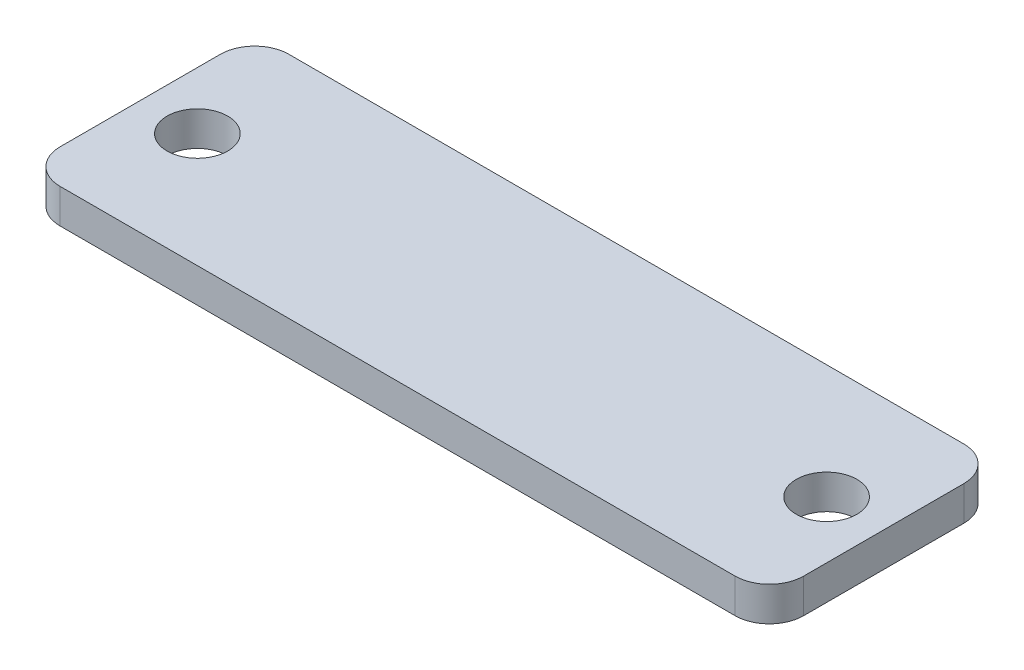
ISO-10303-21;
HEADER;
FILE_DESCRIPTION(('STEP AP214'),'2;1');
FILE_NAME('part.step','',(''),(''),'','','');
FILE_SCHEMA(('AUTOMOTIVE_DESIGN { 1 0 10303 214 1 1 1 1 }'));
ENDSEC;
DATA;
#1=APPLICATION_CONTEXT('core data for automotive mechanical design processes');
#2=APPLICATION_PROTOCOL_DEFINITION('international standard','automotive_design',2000,#1);
#3=PRODUCT_CONTEXT('',#1,'mechanical');
#4=PRODUCT('Part','Part','',(#3));
#5=PRODUCT_RELATED_PRODUCT_CATEGORY('part','',(#4));
#6=PRODUCT_DEFINITION_FORMATION('','',#4);
#7=PRODUCT_DEFINITION_CONTEXT('part definition',#1,'design');
#8=PRODUCT_DEFINITION('design','',#6,#7);
#9=PRODUCT_DEFINITION_SHAPE('','',#8);
#10=(LENGTH_UNIT() NAMED_UNIT(*) SI_UNIT(.MILLI.,.METRE.));
#11=(NAMED_UNIT(*) PLANE_ANGLE_UNIT() SI_UNIT($,.RADIAN.));
#12=(NAMED_UNIT(*) SI_UNIT($,.STERADIAN.) SOLID_ANGLE_UNIT());
#13=UNCERTAINTY_MEASURE_WITH_UNIT(LENGTH_MEASURE(1.E-05),#10,'distance_accuracy_value','');
#14=(GEOMETRIC_REPRESENTATION_CONTEXT(3) GLOBAL_UNCERTAINTY_ASSIGNED_CONTEXT((#13)) GLOBAL_UNIT_ASSIGNED_CONTEXT((#10,
#11,#12)) REPRESENTATION_CONTEXT('',''));
#15=CARTESIAN_POINT('',(0.,0.,0.));
#16=DIRECTION('',(0.,0.,1.));
#17=DIRECTION('',(1.,0.,0.));
#18=AXIS2_PLACEMENT_3D('',#15,#16,#17);
#19=CARTESIAN_POINT('',(0.,3.,0.));
#20=DIRECTION('',(0.,1.,0.));
#21=DIRECTION('',(0.,0.,1.));
#22=AXIS2_PLACEMENT_3D('',#19,#20,#21);
#23=PLANE('',#22);
#24=CARTESIAN_POINT('',(-27.5,3.,19.));
#25=DIRECTION('',(0.,-1.,0.));
#26=DIRECTION('',(0.,0.,-1.));
#27=AXIS2_PLACEMENT_3D('',#24,#25,#26);
#28=CIRCLE('',#27,2.65);
#29=CARTESIAN_POINT('',(-27.5,3.,16.35));
#30=VERTEX_POINT('',#29);
#31=EDGE_CURVE('E206',#30,#30,#28,.T.);
#32=ORIENTED_EDGE('',*,*,#31,.T.);
#33=EDGE_LOOP('',(#32));
#34=FACE_BOUND('',#33,.T.);
#35=CARTESIAN_POINT('',(27.5,3.,19.));
#36=DIRECTION('',(0.,-1.,0.));
#37=DIRECTION('',(0.,0.,-1.));
#38=AXIS2_PLACEMENT_3D('',#35,#36,#37);
#39=CIRCLE('',#38,2.65);
#40=CARTESIAN_POINT('',(27.5,3.,16.35));
#41=VERTEX_POINT('',#40);
#42=EDGE_CURVE('E198',#41,#41,#39,.T.);
#43=ORIENTED_EDGE('',*,*,#42,.T.);
#44=EDGE_LOOP('',(#43));
#45=FACE_BOUND('',#44,.T.);
#46=DIRECTION('',(1.,0.,0.));
#47=VECTOR('',#46,1.);
#48=CARTESIAN_POINT('',(0.,3.,29.));
#49=LINE('',#48,#47);
#50=CARTESIAN_POINT('',(-29.5,3.,29.));
#51=VERTEX_POINT('',#50);
#52=CARTESIAN_POINT('',(29.5,3.,29.));
#53=VERTEX_POINT('',#52);
#54=EDGE_CURVE('E140',#51,#53,#49,.T.);
#55=ORIENTED_EDGE('',*,*,#54,.T.);
#56=CARTESIAN_POINT('',(29.5,3.,26.));
#57=DIRECTION('',(0.,1.,0.));
#58=DIRECTION('',(0.,0.,1.));
#59=AXIS2_PLACEMENT_3D('',#56,#57,#58);
#60=CIRCLE('',#59,3.);
#61=CARTESIAN_POINT('',(32.5,3.,26.));
#62=VERTEX_POINT('',#61);
#63=EDGE_CURVE('E168',#53,#62,#60,.T.);
#64=ORIENTED_EDGE('',*,*,#63,.T.);
#65=DIRECTION('',(0.,0.,-1.));
#66=VECTOR('',#65,1.);
#67=CARTESIAN_POINT('',(32.5,3.,0.));
#68=LINE('',#67,#66);
#69=CARTESIAN_POINT('',(32.5,3.,12.));
#70=VERTEX_POINT('',#69);
#71=EDGE_CURVE('E127',#62,#70,#68,.T.);
#72=ORIENTED_EDGE('',*,*,#71,.T.);
#73=CARTESIAN_POINT('',(29.5,3.,12.));
#74=DIRECTION('',(0.,1.,0.));
#75=DIRECTION('',(0.,0.,1.));
#76=AXIS2_PLACEMENT_3D('',#73,#74,#75);
#77=CIRCLE('',#76,3.);
#78=CARTESIAN_POINT('',(29.5,3.,9.));
#79=VERTEX_POINT('',#78);
#80=EDGE_CURVE('E160',#70,#79,#77,.T.);
#81=ORIENTED_EDGE('',*,*,#80,.T.);
#82=DIRECTION('',(1.,0.,0.));
#83=VECTOR('',#82,1.);
#84=CARTESIAN_POINT('',(0.,3.,9.));
#85=LINE('',#84,#83);
#86=CARTESIAN_POINT('',(-29.5,3.,9.));
#87=VERTEX_POINT('',#86);
#88=EDGE_CURVE('E185',#87,#79,#85,.T.);
#89=ORIENTED_EDGE('',*,*,#88,.F.);
#90=CARTESIAN_POINT('',(-29.5,3.,12.));
#91=DIRECTION('',(0.,1.,0.));
#92=DIRECTION('',(0.,0.,1.));
#93=AXIS2_PLACEMENT_3D('',#90,#91,#92);
#94=CIRCLE('',#93,3.);
#95=CARTESIAN_POINT('',(-32.5,3.,12.));
#96=VERTEX_POINT('',#95);
#97=EDGE_CURVE('E55',#87,#96,#94,.T.);
#98=ORIENTED_EDGE('',*,*,#97,.T.);
#99=DIRECTION('',(0.,0.,-1.));
#100=VECTOR('',#99,1.);
#101=CARTESIAN_POINT('',(-32.5,3.,0.));
#102=LINE('',#101,#100);
#103=CARTESIAN_POINT('',(-32.5,3.,26.));
#104=VERTEX_POINT('',#103);
#105=EDGE_CURVE('E135',#104,#96,#102,.T.);
#106=ORIENTED_EDGE('',*,*,#105,.F.);
#107=CARTESIAN_POINT('',(-29.5,3.,26.));
#108=DIRECTION('',(0.,1.,0.));
#109=DIRECTION('',(0.,0.,1.));
#110=AXIS2_PLACEMENT_3D('',#107,#108,#109);
#111=CIRCLE('',#110,3.);
#112=EDGE_CURVE('E165',#104,#51,#111,.T.);
#113=ORIENTED_EDGE('',*,*,#112,.T.);
#114=EDGE_LOOP('',(#55,#64,#72,#81,#89,#98,#106,#113));
#115=FACE_BOUND('',#114,.T.);
#116=ADVANCED_FACE('F39',(#34,#45,#115),#23,.T.);
#117=CARTESIAN_POINT('',(0.,0.,0.));
#118=DIRECTION('',(0.,1.,0.));
#119=DIRECTION('',(0.,0.,1.));
#120=AXIS2_PLACEMENT_3D('',#117,#118,#119);
#121=PLANE('',#120);
#122=CARTESIAN_POINT('',(-27.5,0.,19.));
#123=DIRECTION('',(0.,-1.,0.));
#124=DIRECTION('',(0.,0.,-1.));
#125=AXIS2_PLACEMENT_3D('',#122,#123,#124);
#126=CIRCLE('',#125,2.65);
#127=CARTESIAN_POINT('',(-27.5,0.,16.35));
#128=VERTEX_POINT('',#127);
#129=EDGE_CURVE('E202',#128,#128,#126,.T.);
#130=ORIENTED_EDGE('',*,*,#129,.F.);
#131=EDGE_LOOP('',(#130));
#132=FACE_BOUND('',#131,.T.);
#133=CARTESIAN_POINT('',(27.5,0.,19.));
#134=DIRECTION('',(0.,-1.,0.));
#135=DIRECTION('',(0.,0.,-1.));
#136=AXIS2_PLACEMENT_3D('',#133,#134,#135);
#137=CIRCLE('',#136,2.65);
#138=CARTESIAN_POINT('',(27.5,0.,16.35));
#139=VERTEX_POINT('',#138);
#140=EDGE_CURVE('E192',#139,#139,#137,.T.);
#141=ORIENTED_EDGE('',*,*,#140,.F.);
#142=EDGE_LOOP('',(#141));
#143=FACE_BOUND('',#142,.T.);
#144=DIRECTION('',(0.,0.,-1.));
#145=VECTOR('',#144,1.);
#146=CARTESIAN_POINT('',(32.5,0.,0.));
#147=LINE('',#146,#145);
#148=CARTESIAN_POINT('',(32.5,0.,26.));
#149=VERTEX_POINT('',#148);
#150=CARTESIAN_POINT('',(32.5,0.,12.));
#151=VERTEX_POINT('',#150);
#152=EDGE_CURVE('E124',#149,#151,#147,.T.);
#153=ORIENTED_EDGE('',*,*,#152,.F.);
#154=CARTESIAN_POINT('',(29.5,0.,26.));
#155=DIRECTION('',(0.,1.,0.));
#156=DIRECTION('',(0.,0.,1.));
#157=AXIS2_PLACEMENT_3D('',#154,#155,#156);
#158=CIRCLE('',#157,3.);
#159=CARTESIAN_POINT('',(29.5,0.,29.));
#160=VERTEX_POINT('',#159);
#161=EDGE_CURVE('E106',#149,#160,#158,.F.);
#162=ORIENTED_EDGE('',*,*,#161,.T.);
#163=DIRECTION('',(1.,0.,0.));
#164=VECTOR('',#163,1.);
#165=CARTESIAN_POINT('',(0.,0.,29.));
#166=LINE('',#165,#164);
#167=CARTESIAN_POINT('',(-29.5,0.,29.));
#168=VERTEX_POINT('',#167);
#169=EDGE_CURVE('E136',#168,#160,#166,.T.);
#170=ORIENTED_EDGE('',*,*,#169,.F.);
#171=CARTESIAN_POINT('',(-29.5,0.,26.));
#172=DIRECTION('',(0.,1.,0.));
#173=DIRECTION('',(0.,0.,1.));
#174=AXIS2_PLACEMENT_3D('',#171,#172,#173);
#175=CIRCLE('',#174,3.);
#176=CARTESIAN_POINT('',(-32.5,0.,26.));
#177=VERTEX_POINT('',#176);
#178=EDGE_CURVE('E118',#168,#177,#175,.F.);
#179=ORIENTED_EDGE('',*,*,#178,.T.);
#180=DIRECTION('',(0.,0.,-1.));
#181=VECTOR('',#180,1.);
#182=CARTESIAN_POINT('',(-32.5,0.,0.));
#183=LINE('',#182,#181);
#184=CARTESIAN_POINT('',(-32.5,0.,12.));
#185=VERTEX_POINT('',#184);
#186=EDGE_CURVE('E142',#177,#185,#183,.T.);
#187=ORIENTED_EDGE('',*,*,#186,.T.);
#188=CARTESIAN_POINT('',(-29.5,0.,12.));
#189=DIRECTION('',(0.,1.,0.));
#190=DIRECTION('',(0.,0.,1.));
#191=AXIS2_PLACEMENT_3D('',#188,#189,#190);
#192=CIRCLE('',#191,3.);
#193=CARTESIAN_POINT('',(-29.5,0.,9.));
#194=VERTEX_POINT('',#193);
#195=EDGE_CURVE('E150',#185,#194,#192,.F.);
#196=ORIENTED_EDGE('',*,*,#195,.T.);
#197=DIRECTION('',(1.,0.,0.));
#198=VECTOR('',#197,1.);
#199=CARTESIAN_POINT('',(0.,0.,9.));
#200=LINE('',#199,#198);
#201=CARTESIAN_POINT('',(29.5,0.,9.));
#202=VERTEX_POINT('',#201);
#203=EDGE_CURVE('E183',#194,#202,#200,.T.);
#204=ORIENTED_EDGE('',*,*,#203,.T.);
#205=CARTESIAN_POINT('',(29.5,0.,12.));
#206=DIRECTION('',(0.,1.,0.));
#207=DIRECTION('',(0.,0.,1.));
#208=AXIS2_PLACEMENT_3D('',#205,#206,#207);
#209=CIRCLE('',#208,3.);
#210=EDGE_CURVE('E129',#202,#151,#209,.F.);
#211=ORIENTED_EDGE('',*,*,#210,.T.);
#212=EDGE_LOOP('',(#153,#162,#170,#179,#187,#196,#204,#211));
#213=FACE_BOUND('',#212,.T.);
#214=ADVANCED_FACE('F132',(#132,#143,#213),#121,.F.);
#215=CARTESIAN_POINT('',(-32.5,3.,0.));
#216=DIRECTION('',(-1.,0.,0.));
#217=DIRECTION('',(0.,0.,1.));
#218=AXIS2_PLACEMENT_3D('',#215,#216,#217);
#219=PLANE('',#218);
#220=ORIENTED_EDGE('',*,*,#186,.F.);
#221=DIRECTION('',(0.,-1.,0.));
#222=VECTOR('',#221,1.);
#223=CARTESIAN_POINT('',(-32.5,3.,26.));
#224=LINE('',#223,#222);
#225=EDGE_CURVE('E62',#177,#104,#224,.F.);
#226=ORIENTED_EDGE('',*,*,#225,.T.);
#227=ORIENTED_EDGE('',*,*,#105,.T.);
#228=DIRECTION('',(0.,-1.,0.));
#229=VECTOR('',#228,1.);
#230=CARTESIAN_POINT('',(-32.5,3.,12.));
#231=LINE('',#230,#229);
#232=EDGE_CURVE('E171',#96,#185,#231,.T.);
#233=ORIENTED_EDGE('',*,*,#232,.T.);
#234=EDGE_LOOP('',(#220,#226,#227,#233));
#235=FACE_BOUND('',#234,.T.);
#236=ADVANCED_FACE('F215',(#235),#219,.T.);
#237=CARTESIAN_POINT('',(0.,3.,29.));
#238=DIRECTION('',(0.,0.,-1.));
#239=DIRECTION('',(-1.,0.,0.));
#240=AXIS2_PLACEMENT_3D('',#237,#238,#239);
#241=PLANE('',#240);
#242=ORIENTED_EDGE('',*,*,#169,.T.);
#243=DIRECTION('',(0.,-1.,0.));
#244=VECTOR('',#243,1.);
#245=CARTESIAN_POINT('',(29.5,3.,29.));
#246=LINE('',#245,#244);
#247=EDGE_CURVE('E111',#160,#53,#246,.F.);
#248=ORIENTED_EDGE('',*,*,#247,.T.);
#249=ORIENTED_EDGE('',*,*,#54,.F.);
#250=DIRECTION('',(0.,-1.,0.));
#251=VECTOR('',#250,1.);
#252=CARTESIAN_POINT('',(-29.5,0.,29.));
#253=LINE('',#252,#251);
#254=EDGE_CURVE('E117',#51,#168,#253,.T.);
#255=ORIENTED_EDGE('',*,*,#254,.T.);
#256=EDGE_LOOP('',(#242,#248,#249,#255));
#257=FACE_BOUND('',#256,.T.);
#258=ADVANCED_FACE('F223',(#257),#241,.F.);
#259=CARTESIAN_POINT('',(32.5,3.,0.));
#260=DIRECTION('',(-1.,0.,0.));
#261=DIRECTION('',(0.,0.,1.));
#262=AXIS2_PLACEMENT_3D('',#259,#260,#261);
#263=PLANE('',#262);
#264=ORIENTED_EDGE('',*,*,#71,.F.);
#265=DIRECTION('',(0.,-1.,0.));
#266=VECTOR('',#265,1.);
#267=CARTESIAN_POINT('',(32.5,3.,26.));
#268=LINE('',#267,#266);
#269=EDGE_CURVE('E110',#62,#149,#268,.T.);
#270=ORIENTED_EDGE('',*,*,#269,.T.);
#271=ORIENTED_EDGE('',*,*,#152,.T.);
#272=DIRECTION('',(0.,-1.,0.));
#273=VECTOR('',#272,1.);
#274=CARTESIAN_POINT('',(32.5,3.,12.));
#275=LINE('',#274,#273);
#276=EDGE_CURVE('E130',#151,#70,#275,.F.);
#277=ORIENTED_EDGE('',*,*,#276,.T.);
#278=EDGE_LOOP('',(#264,#270,#271,#277));
#279=FACE_BOUND('',#278,.T.);
#280=ADVANCED_FACE('F123',(#279),#263,.F.);
#281=CARTESIAN_POINT('',(-27.5,0.,19.));
#282=DIRECTION('',(0.,-1.,0.));
#283=DIRECTION('',(0.,0.,-1.));
#284=AXIS2_PLACEMENT_3D('',#281,#282,#283);
#285=CYLINDRICAL_SURFACE('',#284,2.65);
#286=ORIENTED_EDGE('',*,*,#31,.F.);
#287=EDGE_LOOP('',(#286));
#288=FACE_BOUND('',#287,.T.);
#289=ORIENTED_EDGE('',*,*,#129,.T.);
#290=EDGE_LOOP('',(#289));
#291=FACE_BOUND('',#290,.T.);
#292=ADVANCED_FACE('F230',(#288,#291),#285,.F.);
#293=CARTESIAN_POINT('',(27.5,0.,19.));
#294=DIRECTION('',(0.,-1.,0.));
#295=DIRECTION('',(0.,0.,-1.));
#296=AXIS2_PLACEMENT_3D('',#293,#294,#295);
#297=CYLINDRICAL_SURFACE('',#296,2.65);
#298=ORIENTED_EDGE('',*,*,#42,.F.);
#299=EDGE_LOOP('',(#298));
#300=FACE_BOUND('',#299,.T.);
#301=ORIENTED_EDGE('',*,*,#140,.T.);
#302=EDGE_LOOP('',(#301));
#303=FACE_BOUND('',#302,.T.);
#304=ADVANCED_FACE('F245',(#300,#303),#297,.F.);
#305=CARTESIAN_POINT('',(0.,3.,9.));
#306=DIRECTION('',(0.,0.,-1.));
#307=DIRECTION('',(-1.,0.,0.));
#308=AXIS2_PLACEMENT_3D('',#305,#306,#307);
#309=PLANE('',#308);
#310=ORIENTED_EDGE('',*,*,#203,.F.);
#311=DIRECTION('',(0.,-1.,0.));
#312=VECTOR('',#311,1.);
#313=CARTESIAN_POINT('',(-29.5,3.,9.));
#314=LINE('',#313,#312);
#315=EDGE_CURVE('E11',#194,#87,#314,.F.);
#316=ORIENTED_EDGE('',*,*,#315,.T.);
#317=ORIENTED_EDGE('',*,*,#88,.T.);
#318=DIRECTION('',(0.,-1.,0.));
#319=VECTOR('',#318,1.);
#320=CARTESIAN_POINT('',(29.5,0.,9.));
#321=LINE('',#320,#319);
#322=EDGE_CURVE('E48',#79,#202,#321,.T.);
#323=ORIENTED_EDGE('',*,*,#322,.T.);
#324=EDGE_LOOP('',(#310,#316,#317,#323));
#325=FACE_BOUND('',#324,.T.);
#326=ADVANCED_FACE('F182',(#325),#309,.T.);
#327=CARTESIAN_POINT('',(29.5,3.,26.));
#328=DIRECTION('',(0.,-1.,0.));
#329=DIRECTION('',(0.,0.,-1.));
#330=AXIS2_PLACEMENT_3D('',#327,#328,#329);
#331=CYLINDRICAL_SURFACE('',#330,3.);
#332=ORIENTED_EDGE('',*,*,#63,.F.);
#333=ORIENTED_EDGE('',*,*,#247,.F.);
#334=ORIENTED_EDGE('',*,*,#161,.F.);
#335=ORIENTED_EDGE('',*,*,#269,.F.);
#336=EDGE_LOOP('',(#332,#333,#334,#335));
#337=FACE_BOUND('',#336,.T.);
#338=ADVANCED_FACE('F109',(#337),#331,.T.);
#339=CARTESIAN_POINT('',(-29.5,3.,26.));
#340=DIRECTION('',(0.,1.,0.));
#341=DIRECTION('',(0.,0.,1.));
#342=AXIS2_PLACEMENT_3D('',#339,#340,#341);
#343=CYLINDRICAL_SURFACE('',#342,3.);
#344=ORIENTED_EDGE('',*,*,#112,.F.);
#345=ORIENTED_EDGE('',*,*,#225,.F.);
#346=ORIENTED_EDGE('',*,*,#178,.F.);
#347=ORIENTED_EDGE('',*,*,#254,.F.);
#348=EDGE_LOOP('',(#344,#345,#346,#347));
#349=FACE_BOUND('',#348,.T.);
#350=ADVANCED_FACE('F219',(#349),#343,.T.);
#351=CARTESIAN_POINT('',(-29.5,3.,12.));
#352=DIRECTION('',(0.,-1.,0.));
#353=DIRECTION('',(0.,0.,-1.));
#354=AXIS2_PLACEMENT_3D('',#351,#352,#353);
#355=CYLINDRICAL_SURFACE('',#354,3.);
#356=ORIENTED_EDGE('',*,*,#97,.F.);
#357=ORIENTED_EDGE('',*,*,#315,.F.);
#358=ORIENTED_EDGE('',*,*,#195,.F.);
#359=ORIENTED_EDGE('',*,*,#232,.F.);
#360=EDGE_LOOP('',(#356,#357,#358,#359));
#361=FACE_BOUND('',#360,.T.);
#362=ADVANCED_FACE('F258',(#361),#355,.T.);
#363=CARTESIAN_POINT('',(29.5,3.,12.));
#364=DIRECTION('',(0.,1.,0.));
#365=DIRECTION('',(0.,0.,1.));
#366=AXIS2_PLACEMENT_3D('',#363,#364,#365);
#367=CYLINDRICAL_SURFACE('',#366,3.);
#368=ORIENTED_EDGE('',*,*,#80,.F.);
#369=ORIENTED_EDGE('',*,*,#276,.F.);
#370=ORIENTED_EDGE('',*,*,#210,.F.);
#371=ORIENTED_EDGE('',*,*,#322,.F.);
#372=EDGE_LOOP('',(#368,#369,#370,#371));
#373=FACE_BOUND('',#372,.T.);
#374=ADVANCED_FACE('F41',(#373),#367,.T.);
#375=CLOSED_SHELL('',(#116,#214,#236,#258,#280,#292,#304,#326,#338,#350,#362,#374));
#376=MANIFOLD_SOLID_BREP('B2',#375);
#377=ADVANCED_BREP_SHAPE_REPRESENTATION('',(#18,#376),#14);
#378=SHAPE_DEFINITION_REPRESENTATION(#9,#377);
ENDSEC;
END-ISO-10303-21;
